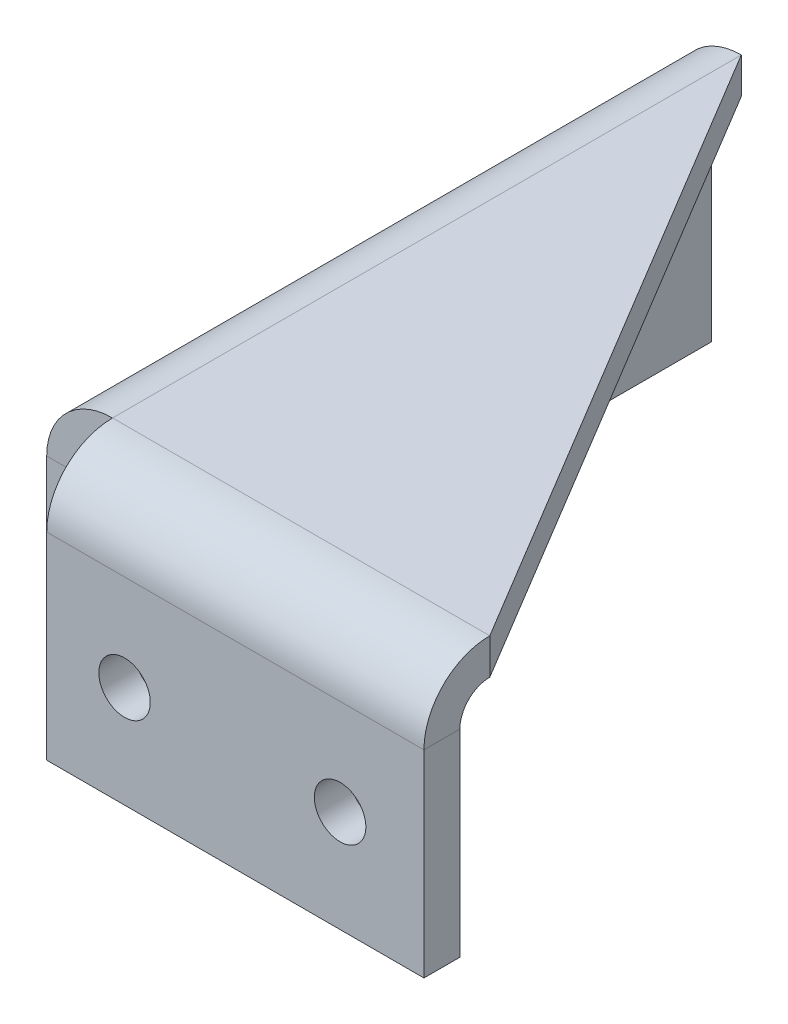
ISO-10303-21;
HEADER;
FILE_DESCRIPTION(('STEP AP214'),'2;1');
FILE_NAME('part.step','',(''),(''),'','','');
FILE_SCHEMA(('AUTOMOTIVE_DESIGN { 1 0 10303 214 1 1 1 1 }'));
ENDSEC;
DATA;
#1=APPLICATION_CONTEXT('core data for automotive mechanical design processes');
#2=APPLICATION_PROTOCOL_DEFINITION('international standard','automotive_design',2000,#1);
#3=PRODUCT_CONTEXT('',#1,'mechanical');
#4=PRODUCT('Part','Part','',(#3));
#5=PRODUCT_RELATED_PRODUCT_CATEGORY('part','',(#4));
#6=PRODUCT_DEFINITION_FORMATION('','',#4);
#7=PRODUCT_DEFINITION_CONTEXT('part definition',#1,'design');
#8=PRODUCT_DEFINITION('design','',#6,#7);
#9=PRODUCT_DEFINITION_SHAPE('','',#8);
#10=(LENGTH_UNIT() NAMED_UNIT(*) SI_UNIT(.MILLI.,.METRE.));
#11=(NAMED_UNIT(*) PLANE_ANGLE_UNIT() SI_UNIT($,.RADIAN.));
#12=(NAMED_UNIT(*) SI_UNIT($,.STERADIAN.) SOLID_ANGLE_UNIT());
#13=UNCERTAINTY_MEASURE_WITH_UNIT(LENGTH_MEASURE(1.E-05),#10,'distance_accuracy_value','');
#14=(GEOMETRIC_REPRESENTATION_CONTEXT(3) GLOBAL_UNCERTAINTY_ASSIGNED_CONTEXT((#13)) GLOBAL_UNIT_ASSIGNED_CONTEXT((#10,
#11,#12)) REPRESENTATION_CONTEXT('',''));
#15=CARTESIAN_POINT('',(0.,0.,0.));
#16=DIRECTION('',(0.,0.,1.));
#17=DIRECTION('',(1.,0.,0.));
#18=AXIS2_PLACEMENT_3D('',#15,#16,#17);
#19=CARTESIAN_POINT('',(0.,-3.,0.));
#20=DIRECTION('',(0.,1.,0.));
#21=DIRECTION('',(0.,0.,1.));
#22=AXIS2_PLACEMENT_3D('',#19,#20,#21);
#23=PLANE('',#22);
#24=DIRECTION('',(0.514495755427527,0.,0.857492925712544));
#25=VECTOR('',#24,1.);
#26=CARTESIAN_POINT('',(0.,-3.,0.));
#27=LINE('',#26,#25);
#28=CARTESIAN_POINT('',(-31.5,-3.00000000000001,-52.5));
#29=VERTEX_POINT('',#28);
#30=CARTESIAN_POINT('',(0.,-2.99999999999999,0.));
#31=VERTEX_POINT('',#30);
#32=EDGE_CURVE('E213',#29,#31,#27,.T.);
#33=ORIENTED_EDGE('',*,*,#32,.T.);
#34=DIRECTION('',(1.,0.,0.));
#35=VECTOR('',#34,1.);
#36=CARTESIAN_POINT('',(0.,-3.,0.));
#37=LINE('',#36,#35);
#38=CARTESIAN_POINT('',(-31.5,-3.,0.));
#39=VERTEX_POINT('',#38);
#40=EDGE_CURVE('E219',#39,#31,#37,.T.);
#41=ORIENTED_EDGE('',*,*,#40,.F.);
#42=DIRECTION('',(0.,0.,1.));
#43=VECTOR('',#42,1.);
#44=CARTESIAN_POINT('',(-31.5,-3.,0.));
#45=LINE('',#44,#43);
#46=EDGE_CURVE('E220',#29,#39,#45,.T.);
#47=ORIENTED_EDGE('',*,*,#46,.F.);
#48=EDGE_LOOP('',(#33,#41,#47));
#49=FACE_BOUND('',#48,.T.);
#50=ADVANCED_FACE('F90',(#49),#23,.F.);
#51=CARTESIAN_POINT('',(0.,0.,0.));
#52=DIRECTION('',(0.,1.,0.));
#53=DIRECTION('',(0.,0.,1.));
#54=AXIS2_PLACEMENT_3D('',#51,#52,#53);
#55=PLANE('',#54);
#56=DIRECTION('',(1.,0.,0.));
#57=VECTOR('',#56,1.);
#58=CARTESIAN_POINT('',(0.,0.,0.));
#59=LINE('',#58,#57);
#60=CARTESIAN_POINT('',(-31.5,0.,0.));
#61=VERTEX_POINT('',#60);
#62=CARTESIAN_POINT('',(0.,0.,0.));
#63=VERTEX_POINT('',#62);
#64=EDGE_CURVE('E238',#61,#63,#59,.T.);
#65=ORIENTED_EDGE('',*,*,#64,.T.);
#66=DIRECTION('',(0.514495755427527,0.,0.857492925712544));
#67=VECTOR('',#66,1.);
#68=CARTESIAN_POINT('',(0.,0.,0.));
#69=LINE('',#68,#67);
#70=CARTESIAN_POINT('',(-31.5,0.,-52.5));
#71=VERTEX_POINT('',#70);
#72=EDGE_CURVE('E208',#71,#63,#69,.T.);
#73=ORIENTED_EDGE('',*,*,#72,.F.);
#74=DIRECTION('',(0.,0.,1.));
#75=VECTOR('',#74,1.);
#76=CARTESIAN_POINT('',(-31.5,0.,0.));
#77=LINE('',#76,#75);
#78=EDGE_CURVE('E240',#71,#61,#77,.T.);
#79=ORIENTED_EDGE('',*,*,#78,.T.);
#80=EDGE_LOOP('',(#65,#73,#79));
#81=FACE_BOUND('',#80,.T.);
#82=ADVANCED_FACE('F92',(#81),#55,.T.);
#83=CARTESIAN_POINT('',(0.,-5.49999999999999,0.));
#84=DIRECTION('',(1.,0.,0.));
#85=DIRECTION('',(0.,0.,-1.));
#86=AXIS2_PLACEMENT_3D('',#83,#84,#85);
#87=PLANE('',#86);
#88=DIRECTION('',(0.,0.,1.));
#89=VECTOR('',#88,1.);
#90=CARTESIAN_POINT('',(0.,-5.49999999999999,5.50000000000006));
#91=LINE('',#90,#89);
#92=CARTESIAN_POINT('',(0.,-5.49999999999998,2.5));
#93=VERTEX_POINT('',#92);
#94=CARTESIAN_POINT('',(0.,-5.49999999999997,5.5));
#95=VERTEX_POINT('',#94);
#96=EDGE_CURVE('E121',#93,#95,#91,.T.);
#97=ORIENTED_EDGE('',*,*,#96,.F.);
#98=CARTESIAN_POINT('',(0.,-5.49999999999999,0.));
#99=DIRECTION('',(-1.,0.,0.));
#100=DIRECTION('',(0.,0.,1.));
#101=AXIS2_PLACEMENT_3D('',#98,#99,#100);
#102=CIRCLE('',#101,2.5);
#103=EDGE_CURVE('E226',#31,#93,#102,.F.);
#104=ORIENTED_EDGE('',*,*,#103,.F.);
#105=DIRECTION('',(0.,1.,0.));
#106=VECTOR('',#105,1.);
#107=CARTESIAN_POINT('',(0.,-3.,0.));
#108=LINE('',#107,#106);
#109=EDGE_CURVE('E15',#31,#63,#108,.T.);
#110=ORIENTED_EDGE('',*,*,#109,.T.);
#111=CARTESIAN_POINT('',(0.,-5.49999999999999,0.));
#112=DIRECTION('',(-1.,0.,0.));
#113=DIRECTION('',(0.,0.,1.));
#114=AXIS2_PLACEMENT_3D('',#111,#112,#113);
#115=CIRCLE('',#114,5.5);
#116=EDGE_CURVE('E232',#63,#95,#115,.F.);
#117=ORIENTED_EDGE('',*,*,#116,.T.);
#118=EDGE_LOOP('',(#97,#104,#110,#117));
#119=FACE_BOUND('',#118,.T.);
#120=ADVANCED_FACE('F230',(#119),#87,.T.);
#121=CARTESIAN_POINT('',(-31.5,-5.49999999999999,0.));
#122=DIRECTION('',(1.,0.,0.));
#123=DIRECTION('',(0.,0.,-1.));
#124=AXIS2_PLACEMENT_3D('',#121,#122,#123);
#125=PLANE('',#124);
#126=CARTESIAN_POINT('',(-31.5,-5.49999999999999,0.));
#127=DIRECTION('',(-1.,0.,0.));
#128=DIRECTION('',(0.,0.,1.));
#129=AXIS2_PLACEMENT_3D('',#126,#127,#128);
#130=CIRCLE('',#129,2.5);
#131=CARTESIAN_POINT('',(-31.5,-5.49999999999998,2.50000000000001));
#132=VERTEX_POINT('',#131);
#133=EDGE_CURVE('E228',#132,#39,#130,.T.);
#134=ORIENTED_EDGE('',*,*,#133,.F.);
#135=DIRECTION('',(0.,0.,1.));
#136=VECTOR('',#135,1.);
#137=CARTESIAN_POINT('',(-31.5,-5.49999999999999,2.5));
#138=LINE('',#137,#136);
#139=CARTESIAN_POINT('',(-31.5,-5.49999999999999,5.5));
#140=VERTEX_POINT('',#139);
#141=EDGE_CURVE('E251',#132,#140,#138,.T.);
#142=ORIENTED_EDGE('',*,*,#141,.T.);
#143=CARTESIAN_POINT('',(-31.5,-5.49999999999999,0.));
#144=DIRECTION('',(-1.,0.,0.));
#145=DIRECTION('',(0.,0.,1.));
#146=AXIS2_PLACEMENT_3D('',#143,#144,#145);
#147=CIRCLE('',#146,5.5);
#148=EDGE_CURVE('E130',#140,#61,#147,.T.);
#149=ORIENTED_EDGE('',*,*,#148,.T.);
#150=DIRECTION('',(0.,1.,0.));
#151=VECTOR('',#150,1.);
#152=CARTESIAN_POINT('',(-31.5,-3.,0.));
#153=LINE('',#152,#151);
#154=EDGE_CURVE('E100',#39,#61,#153,.T.);
#155=ORIENTED_EDGE('',*,*,#154,.F.);
#156=EDGE_LOOP('',(#134,#142,#149,#155));
#157=FACE_BOUND('',#156,.T.);
#158=ADVANCED_FACE('F249',(#157),#125,.F.);
#159=CARTESIAN_POINT('',(-31.5,-5.49999999999999,0.));
#160=DIRECTION('',(-1.,0.,0.));
#161=DIRECTION('',(0.,0.,1.));
#162=AXIS2_PLACEMENT_3D('',#159,#160,#161);
#163=CYLINDRICAL_SURFACE('',#162,5.5);
#164=ORIENTED_EDGE('',*,*,#64,.F.);
#165=ORIENTED_EDGE('',*,*,#148,.F.);
#166=DIRECTION('',(-1.,0.,0.));
#167=VECTOR('',#166,1.);
#168=CARTESIAN_POINT('',(0.,-5.49999999999999,5.5));
#169=LINE('',#168,#167);
#170=EDGE_CURVE('E284',#95,#140,#169,.T.);
#171=ORIENTED_EDGE('',*,*,#170,.F.);
#172=ORIENTED_EDGE('',*,*,#116,.F.);
#173=EDGE_LOOP('',(#164,#165,#171,#172));
#174=FACE_BOUND('',#173,.T.);
#175=ADVANCED_FACE('F247',(#174),#163,.T.);
#176=CARTESIAN_POINT('',(-31.5,-5.49999999999999,0.));
#177=DIRECTION('',(-1.,0.,0.));
#178=DIRECTION('',(0.,0.,1.));
#179=AXIS2_PLACEMENT_3D('',#176,#177,#178);
#180=CYLINDRICAL_SURFACE('',#179,2.5);
#181=ORIENTED_EDGE('',*,*,#40,.T.);
#182=ORIENTED_EDGE('',*,*,#103,.T.);
#183=DIRECTION('',(1.,0.,0.));
#184=VECTOR('',#183,1.);
#185=CARTESIAN_POINT('',(0.,-5.49999999999999,2.5));
#186=LINE('',#185,#184);
#187=EDGE_CURVE('E287',#93,#132,#186,.F.);
#188=ORIENTED_EDGE('',*,*,#187,.T.);
#189=ORIENTED_EDGE('',*,*,#133,.T.);
#190=EDGE_LOOP('',(#181,#182,#188,#189));
#191=FACE_BOUND('',#190,.T.);
#192=ADVANCED_FACE('F225',(#191),#180,.F.);
#193=CARTESIAN_POINT('',(-31.5,-2.99999999999999,5.5));
#194=DIRECTION('',(-1.,0.,0.));
#195=DIRECTION('',(0.,0.,1.));
#196=AXIS2_PLACEMENT_3D('',#193,#194,#195);
#197=PLANE('',#196);
#198=DIRECTION('',(0.,1.,0.));
#199=VECTOR('',#198,1.);
#200=CARTESIAN_POINT('',(-31.5,-2.99999999999999,5.5));
#201=LINE('',#200,#199);
#202=CARTESIAN_POINT('',(-31.5,-22.,5.50000000000006));
#203=VERTEX_POINT('',#202);
#204=EDGE_CURVE('E275',#203,#140,#201,.T.);
#205=ORIENTED_EDGE('',*,*,#204,.T.);
#206=ORIENTED_EDGE('',*,*,#141,.F.);
#207=DIRECTION('',(0.,-1.,0.));
#208=VECTOR('',#207,1.);
#209=CARTESIAN_POINT('',(-31.5,0.,2.49999999999998));
#210=LINE('',#209,#208);
#211=CARTESIAN_POINT('',(-31.5,-22.,2.50000000000006));
#212=VERTEX_POINT('',#211);
#213=EDGE_CURVE('E281',#212,#132,#210,.F.);
#214=ORIENTED_EDGE('',*,*,#213,.F.);
#215=DIRECTION('',(0.,0.,-1.));
#216=VECTOR('',#215,1.);
#217=CARTESIAN_POINT('',(-31.5,-22.,5.50000000000006));
#218=LINE('',#217,#216);
#219=EDGE_CURVE('E234',#203,#212,#218,.T.);
#220=ORIENTED_EDGE('',*,*,#219,.F.);
#221=EDGE_LOOP('',(#205,#206,#214,#220));
#222=FACE_BOUND('',#221,.T.);
#223=ADVANCED_FACE('F303',(#222),#197,.T.);
#224=CARTESIAN_POINT('',(0.,-22.,5.50000000000006));
#225=DIRECTION('',(1.,0.,0.));
#226=DIRECTION('',(0.,0.,-1.));
#227=AXIS2_PLACEMENT_3D('',#224,#225,#226);
#228=PLANE('',#227);
#229=DIRECTION('',(0.,1.,0.));
#230=VECTOR('',#229,1.);
#231=CARTESIAN_POINT('',(0.,0.,2.49999999999998));
#232=LINE('',#231,#230);
#233=CARTESIAN_POINT('',(0.,-22.,2.50000000000006));
#234=VERTEX_POINT('',#233);
#235=EDGE_CURVE('E150',#93,#234,#232,.F.);
#236=ORIENTED_EDGE('',*,*,#235,.F.);
#237=ORIENTED_EDGE('',*,*,#96,.T.);
#238=DIRECTION('',(0.,-1.,0.));
#239=VECTOR('',#238,1.);
#240=CARTESIAN_POINT('',(0.,-22.,5.50000000000006));
#241=LINE('',#240,#239);
#242=CARTESIAN_POINT('',(0.,-22.,5.50000000000006));
#243=VERTEX_POINT('',#242);
#244=EDGE_CURVE('E273',#95,#243,#241,.T.);
#245=ORIENTED_EDGE('',*,*,#244,.T.);
#246=DIRECTION('',(0.,0.,-1.));
#247=VECTOR('',#246,1.);
#248=CARTESIAN_POINT('',(0.,-22.,5.50000000000006));
#249=LINE('',#248,#247);
#250=EDGE_CURVE('E268',#243,#234,#249,.T.);
#251=ORIENTED_EDGE('',*,*,#250,.T.);
#252=EDGE_LOOP('',(#236,#237,#245,#251));
#253=FACE_BOUND('',#252,.T.);
#254=ADVANCED_FACE('F291',(#253),#228,.T.);
#255=CARTESIAN_POINT('',(0.,0.,5.49999999999998));
#256=DIRECTION('',(0.,0.,1.));
#257=DIRECTION('',(0.,-1.,0.));
#258=AXIS2_PLACEMENT_3D('',#255,#256,#257);
#259=PLANE('',#258);
#260=CARTESIAN_POINT('',(-7.,-13.5,5.49999999999998));
#261=DIRECTION('',(0.,0.,-1.));
#262=DIRECTION('',(-1.,0.,0.));
#263=AXIS2_PLACEMENT_3D('',#260,#261,#262);
#264=CIRCLE('',#263,2.15);
#265=CARTESIAN_POINT('',(-9.15,-13.5,5.49999999999998));
#266=VERTEX_POINT('',#265);
#267=EDGE_CURVE('E600',#266,#266,#264,.T.);
#268=ORIENTED_EDGE('',*,*,#267,.T.);
#269=EDGE_LOOP('',(#268));
#270=FACE_BOUND('',#269,.T.);
#271=CARTESIAN_POINT('',(-25.,-13.5,5.49999999999998));
#272=DIRECTION('',(0.,0.,-1.));
#273=DIRECTION('',(-1.,0.,0.));
#274=AXIS2_PLACEMENT_3D('',#271,#272,#273);
#275=CIRCLE('',#274,2.15);
#276=CARTESIAN_POINT('',(-27.15,-13.5,5.49999999999998));
#277=VERTEX_POINT('',#276);
#278=EDGE_CURVE('E221',#277,#277,#275,.T.);
#279=ORIENTED_EDGE('',*,*,#278,.T.);
#280=EDGE_LOOP('',(#279));
#281=FACE_BOUND('',#280,.T.);
#282=ORIENTED_EDGE('',*,*,#244,.F.);
#283=ORIENTED_EDGE('',*,*,#170,.T.);
#284=ORIENTED_EDGE('',*,*,#204,.F.);
#285=DIRECTION('',(-1.,0.,0.));
#286=VECTOR('',#285,1.);
#287=CARTESIAN_POINT('',(-31.5,-22.,5.50000000000006));
#288=LINE('',#287,#286);
#289=EDGE_CURVE('E270',#243,#203,#288,.T.);
#290=ORIENTED_EDGE('',*,*,#289,.F.);
#291=EDGE_LOOP('',(#282,#283,#284,#290));
#292=FACE_BOUND('',#291,.T.);
#293=ADVANCED_FACE('F295',(#270,#281,#292),#259,.T.);
#294=CARTESIAN_POINT('',(0.,0.,2.49999999999998));
#295=DIRECTION('',(0.,0.,1.));
#296=DIRECTION('',(0.,-1.,0.));
#297=AXIS2_PLACEMENT_3D('',#294,#295,#296);
#298=PLANE('',#297);
#299=CARTESIAN_POINT('',(-7.,-13.5,2.49999999999998));
#300=DIRECTION('',(0.,0.,-1.));
#301=DIRECTION('',(-1.,0.,0.));
#302=AXIS2_PLACEMENT_3D('',#299,#300,#301);
#303=CIRCLE('',#302,2.14999999999999);
#304=CARTESIAN_POINT('',(-9.14999999999999,-13.5,2.49999999999998));
#305=VERTEX_POINT('',#304);
#306=EDGE_CURVE('E603',#305,#305,#303,.T.);
#307=ORIENTED_EDGE('',*,*,#306,.F.);
#308=EDGE_LOOP('',(#307));
#309=FACE_BOUND('',#308,.T.);
#310=CARTESIAN_POINT('',(-25.,-13.5,2.49999999999998));
#311=DIRECTION('',(0.,0.,-1.));
#312=DIRECTION('',(-1.,0.,0.));
#313=AXIS2_PLACEMENT_3D('',#310,#311,#312);
#314=CIRCLE('',#313,2.14999999999999);
#315=CARTESIAN_POINT('',(-27.15,-13.5,2.49999999999998));
#316=VERTEX_POINT('',#315);
#317=EDGE_CURVE('E597',#316,#316,#314,.T.);
#318=ORIENTED_EDGE('',*,*,#317,.F.);
#319=EDGE_LOOP('',(#318));
#320=FACE_BOUND('',#319,.T.);
#321=ORIENTED_EDGE('',*,*,#187,.F.);
#322=ORIENTED_EDGE('',*,*,#235,.T.);
#323=DIRECTION('',(1.,0.,0.));
#324=VECTOR('',#323,1.);
#325=CARTESIAN_POINT('',(0.,-22.,2.50000000000006));
#326=LINE('',#325,#324);
#327=EDGE_CURVE('E278',#234,#212,#326,.F.);
#328=ORIENTED_EDGE('',*,*,#327,.T.);
#329=ORIENTED_EDGE('',*,*,#213,.T.);
#330=EDGE_LOOP('',(#321,#322,#328,#329));
#331=FACE_BOUND('',#330,.T.);
#332=ADVANCED_FACE('F301',(#309,#320,#331),#298,.F.);
#333=CARTESIAN_POINT('',(-31.5,-22.,5.50000000000006));
#334=DIRECTION('',(0.,-1.,0.));
#335=DIRECTION('',(0.,0.,-1.));
#336=AXIS2_PLACEMENT_3D('',#333,#334,#335);
#337=PLANE('',#336);
#338=ORIENTED_EDGE('',*,*,#327,.F.);
#339=ORIENTED_EDGE('',*,*,#250,.F.);
#340=ORIENTED_EDGE('',*,*,#289,.T.);
#341=ORIENTED_EDGE('',*,*,#219,.T.);
#342=EDGE_LOOP('',(#338,#339,#340,#341));
#343=FACE_BOUND('',#342,.T.);
#344=ADVANCED_FACE('F299',(#343),#337,.T.);
#345=CARTESIAN_POINT('',(-31.5,-5.49999999999999,0.));
#346=DIRECTION('',(0.,0.,1.));
#347=DIRECTION('',(0.,-1.,0.));
#348=AXIS2_PLACEMENT_3D('',#345,#346,#347);
#349=PLANE('',#348);
#350=DIRECTION('',(-1.,0.,0.));
#351=VECTOR('',#350,1.);
#352=CARTESIAN_POINT('',(-37.,-5.49999999999997,0.));
#353=LINE('',#352,#351);
#354=CARTESIAN_POINT('',(-34.,-5.49999999999998,0.));
#355=VERTEX_POINT('',#354);
#356=CARTESIAN_POINT('',(-37.,-5.49999999999997,0.));
#357=VERTEX_POINT('',#356);
#358=EDGE_CURVE('E171',#355,#357,#353,.T.);
#359=ORIENTED_EDGE('',*,*,#358,.F.);
#360=CARTESIAN_POINT('',(-31.5,-5.49999999999999,0.));
#361=DIRECTION('',(0.,0.,-1.));
#362=DIRECTION('',(0.,1.,0.));
#363=AXIS2_PLACEMENT_3D('',#360,#361,#362);
#364=CIRCLE('',#363,2.5);
#365=EDGE_CURVE('E245',#39,#355,#364,.F.);
#366=ORIENTED_EDGE('',*,*,#365,.F.);
#367=ORIENTED_EDGE('',*,*,#154,.T.);
#368=CARTESIAN_POINT('',(-31.5,-5.49999999999999,0.));
#369=DIRECTION('',(0.,0.,-1.));
#370=DIRECTION('',(0.,1.,0.));
#371=AXIS2_PLACEMENT_3D('',#368,#369,#370);
#372=CIRCLE('',#371,5.5);
#373=EDGE_CURVE('E109',#61,#357,#372,.F.);
#374=ORIENTED_EDGE('',*,*,#373,.T.);
#375=EDGE_LOOP('',(#359,#366,#367,#374));
#376=FACE_BOUND('',#375,.T.);
#377=ADVANCED_FACE('F244',(#376),#349,.T.);
#378=CARTESIAN_POINT('',(-31.5,-5.5,-52.5));
#379=DIRECTION('',(0.,0.,1.));
#380=DIRECTION('',(0.,-1.,0.));
#381=AXIS2_PLACEMENT_3D('',#378,#379,#380);
#382=PLANE('',#381);
#383=CARTESIAN_POINT('',(-31.5,-5.5,-52.5));
#384=DIRECTION('',(0.,0.,-1.));
#385=DIRECTION('',(0.,1.,0.));
#386=AXIS2_PLACEMENT_3D('',#383,#384,#385);
#387=CIRCLE('',#386,2.5);
#388=CARTESIAN_POINT('',(-34.,-5.49999999999999,-52.5));
#389=VERTEX_POINT('',#388);
#390=EDGE_CURVE('E262',#389,#29,#387,.T.);
#391=ORIENTED_EDGE('',*,*,#390,.F.);
#392=DIRECTION('',(-1.,0.,0.));
#393=VECTOR('',#392,1.);
#394=CARTESIAN_POINT('',(-34.,-5.49999999999999,-52.5));
#395=LINE('',#394,#393);
#396=CARTESIAN_POINT('',(-37.,-5.49999999999998,-52.5));
#397=VERTEX_POINT('',#396);
#398=EDGE_CURVE('E259',#389,#397,#395,.T.);
#399=ORIENTED_EDGE('',*,*,#398,.T.);
#400=CARTESIAN_POINT('',(-31.5,-5.5,-52.5));
#401=DIRECTION('',(0.,0.,-1.));
#402=DIRECTION('',(0.,1.,0.));
#403=AXIS2_PLACEMENT_3D('',#400,#401,#402);
#404=CIRCLE('',#403,5.5);
#405=EDGE_CURVE('E177',#397,#71,#404,.T.);
#406=ORIENTED_EDGE('',*,*,#405,.T.);
#407=DIRECTION('',(0.,1.,0.));
#408=VECTOR('',#407,1.);
#409=CARTESIAN_POINT('',(-31.5,-3.,-52.5));
#410=LINE('',#409,#408);
#411=EDGE_CURVE('E94',#29,#71,#410,.T.);
#412=ORIENTED_EDGE('',*,*,#411,.F.);
#413=EDGE_LOOP('',(#391,#399,#406,#412));
#414=FACE_BOUND('',#413,.T.);
#415=ADVANCED_FACE('F256',(#414),#382,.F.);
#416=CARTESIAN_POINT('',(-31.5,-5.5,-52.5));
#417=DIRECTION('',(0.,0.,-1.));
#418=DIRECTION('',(-1.,0.,0.));
#419=AXIS2_PLACEMENT_3D('',#416,#417,#418);
#420=CYLINDRICAL_SURFACE('',#419,5.5);
#421=ORIENTED_EDGE('',*,*,#78,.F.);
#422=ORIENTED_EDGE('',*,*,#405,.F.);
#423=DIRECTION('',(0.,0.,-1.));
#424=VECTOR('',#423,1.);
#425=CARTESIAN_POINT('',(-37.,-5.49999999999997,0.));
#426=LINE('',#425,#424);
#427=EDGE_CURVE('E156',#357,#397,#426,.T.);
#428=ORIENTED_EDGE('',*,*,#427,.F.);
#429=ORIENTED_EDGE('',*,*,#373,.F.);
#430=EDGE_LOOP('',(#421,#422,#428,#429));
#431=FACE_BOUND('',#430,.T.);
#432=ADVANCED_FACE('F253',(#431),#420,.T.);
#433=CARTESIAN_POINT('',(-31.5,-5.5,-52.5));
#434=DIRECTION('',(0.,0.,-1.));
#435=DIRECTION('',(-1.,0.,0.));
#436=AXIS2_PLACEMENT_3D('',#433,#434,#435);
#437=CYLINDRICAL_SURFACE('',#436,2.5);
#438=ORIENTED_EDGE('',*,*,#46,.T.);
#439=ORIENTED_EDGE('',*,*,#365,.T.);
#440=DIRECTION('',(0.,0.,1.));
#441=VECTOR('',#440,1.);
#442=CARTESIAN_POINT('',(-34.,-5.49999999999998,0.));
#443=LINE('',#442,#441);
#444=EDGE_CURVE('E578',#355,#389,#443,.F.);
#445=ORIENTED_EDGE('',*,*,#444,.T.);
#446=ORIENTED_EDGE('',*,*,#390,.T.);
#447=EDGE_LOOP('',(#438,#439,#445,#446));
#448=FACE_BOUND('',#447,.T.);
#449=ADVANCED_FACE('F353',(#448),#437,.F.);
#450=CARTESIAN_POINT('',(-37.,-2.99999999999999,-52.5));
#451=DIRECTION('',(0.,0.,-1.));
#452=DIRECTION('',(0.,1.,0.));
#453=AXIS2_PLACEMENT_3D('',#450,#451,#452);
#454=PLANE('',#453);
#455=DIRECTION('',(0.,1.,0.));
#456=VECTOR('',#455,1.);
#457=CARTESIAN_POINT('',(-37.,-2.99999999999999,-52.5));
#458=LINE('',#457,#456);
#459=CARTESIAN_POINT('',(-37.0000000000001,-22.,-52.5));
#460=VERTEX_POINT('',#459);
#461=EDGE_CURVE('E585',#460,#397,#458,.T.);
#462=ORIENTED_EDGE('',*,*,#461,.T.);
#463=ORIENTED_EDGE('',*,*,#398,.F.);
#464=DIRECTION('',(0.,-1.,0.));
#465=VECTOR('',#464,1.);
#466=CARTESIAN_POINT('',(-34.,0.,-52.5));
#467=LINE('',#466,#465);
#468=CARTESIAN_POINT('',(-34.0000000000001,-22.,-52.5));
#469=VERTEX_POINT('',#468);
#470=EDGE_CURVE('E572',#469,#389,#467,.F.);
#471=ORIENTED_EDGE('',*,*,#470,.F.);
#472=DIRECTION('',(1.,0.,0.));
#473=VECTOR('',#472,1.);
#474=CARTESIAN_POINT('',(-37.0000000000001,-22.,-52.5));
#475=LINE('',#474,#473);
#476=EDGE_CURVE('E192',#460,#469,#475,.T.);
#477=ORIENTED_EDGE('',*,*,#476,.F.);
#478=EDGE_LOOP('',(#462,#463,#471,#477));
#479=FACE_BOUND('',#478,.T.);
#480=ADVANCED_FACE('F363',(#479),#454,.T.);
#481=CARTESIAN_POINT('',(-37.0000000000001,-22.,0.));
#482=DIRECTION('',(0.,0.,1.));
#483=DIRECTION('',(0.,-1.,0.));
#484=AXIS2_PLACEMENT_3D('',#481,#482,#483);
#485=PLANE('',#484);
#486=DIRECTION('',(0.,1.,0.));
#487=VECTOR('',#486,1.);
#488=CARTESIAN_POINT('',(-34.,1.15039556827936E-13,0.));
#489=LINE('',#488,#487);
#490=CARTESIAN_POINT('',(-34.0000000000001,-22.,0.));
#491=VERTEX_POINT('',#490);
#492=EDGE_CURVE('E199',#355,#491,#489,.F.);
#493=ORIENTED_EDGE('',*,*,#492,.F.);
#494=ORIENTED_EDGE('',*,*,#358,.T.);
#495=DIRECTION('',(0.,-1.,0.));
#496=VECTOR('',#495,1.);
#497=CARTESIAN_POINT('',(-37.0000000000001,-22.,0.));
#498=LINE('',#497,#496);
#499=CARTESIAN_POINT('',(-37.0000000000001,-22.,0.));
#500=VERTEX_POINT('',#499);
#501=EDGE_CURVE('E590',#357,#500,#498,.T.);
#502=ORIENTED_EDGE('',*,*,#501,.T.);
#503=DIRECTION('',(1.,0.,0.));
#504=VECTOR('',#503,1.);
#505=CARTESIAN_POINT('',(-37.0000000000001,-22.,0.));
#506=LINE('',#505,#504);
#507=EDGE_CURVE('E569',#500,#491,#506,.T.);
#508=ORIENTED_EDGE('',*,*,#507,.T.);
#509=EDGE_LOOP('',(#493,#494,#502,#508));
#510=FACE_BOUND('',#509,.T.);
#511=ADVANCED_FACE('F436',(#510),#485,.T.);
#512=CARTESIAN_POINT('',(-37.,1.25514000844465E-13,0.));
#513=DIRECTION('',(-1.,0.,0.));
#514=DIRECTION('',(0.,-1.,0.));
#515=AXIS2_PLACEMENT_3D('',#512,#513,#514);
#516=PLANE('',#515);
#517=CARTESIAN_POINT('',(-37.,-13.5,-44.5));
#518=DIRECTION('',(1.,0.,0.));
#519=DIRECTION('',(0.,0.,-1.));
#520=AXIS2_PLACEMENT_3D('',#517,#518,#519);
#521=CIRCLE('',#520,2.15);
#522=CARTESIAN_POINT('',(-37.,-13.5,-46.65));
#523=VERTEX_POINT('',#522);
#524=EDGE_CURVE('E612',#523,#523,#521,.T.);
#525=ORIENTED_EDGE('',*,*,#524,.T.);
#526=EDGE_LOOP('',(#525));
#527=FACE_BOUND('',#526,.T.);
#528=CARTESIAN_POINT('',(-37.,-13.5,-8.49999999999998));
#529=DIRECTION('',(1.,0.,0.));
#530=DIRECTION('',(0.,0.,-1.));
#531=AXIS2_PLACEMENT_3D('',#528,#529,#530);
#532=CIRCLE('',#531,2.15);
#533=CARTESIAN_POINT('',(-37.,-13.5,-10.65));
#534=VERTEX_POINT('',#533);
#535=EDGE_CURVE('E606',#534,#534,#532,.T.);
#536=ORIENTED_EDGE('',*,*,#535,.T.);
#537=EDGE_LOOP('',(#536));
#538=FACE_BOUND('',#537,.T.);
#539=ORIENTED_EDGE('',*,*,#501,.F.);
#540=ORIENTED_EDGE('',*,*,#427,.T.);
#541=ORIENTED_EDGE('',*,*,#461,.F.);
#542=DIRECTION('',(0.,0.,-1.));
#543=VECTOR('',#542,1.);
#544=CARTESIAN_POINT('',(-37.0000000000001,-22.,-52.5));
#545=LINE('',#544,#543);
#546=EDGE_CURVE('E588',#500,#460,#545,.T.);
#547=ORIENTED_EDGE('',*,*,#546,.F.);
#548=EDGE_LOOP('',(#539,#540,#541,#547));
#549=FACE_BOUND('',#548,.T.);
#550=ADVANCED_FACE('F430',(#527,#538,#549),#516,.T.);
#551=CARTESIAN_POINT('',(-34.,1.15039556827936E-13,0.));
#552=DIRECTION('',(-1.,0.,0.));
#553=DIRECTION('',(0.,-1.,0.));
#554=AXIS2_PLACEMENT_3D('',#551,#552,#553);
#555=PLANE('',#554);
#556=CARTESIAN_POINT('',(-33.9999999999999,-13.5,-44.5));
#557=DIRECTION('',(1.,0.,0.));
#558=DIRECTION('',(0.,0.,-1.));
#559=AXIS2_PLACEMENT_3D('',#556,#557,#558);
#560=CIRCLE('',#559,2.14999999999999);
#561=CARTESIAN_POINT('',(-33.9999999999999,-13.5,-46.65));
#562=VERTEX_POINT('',#561);
#563=EDGE_CURVE('E615',#562,#562,#560,.T.);
#564=ORIENTED_EDGE('',*,*,#563,.F.);
#565=EDGE_LOOP('',(#564));
#566=FACE_BOUND('',#565,.T.);
#567=CARTESIAN_POINT('',(-33.9999999999999,-13.5,-8.49999999999998));
#568=DIRECTION('',(1.,0.,0.));
#569=DIRECTION('',(0.,0.,-1.));
#570=AXIS2_PLACEMENT_3D('',#567,#568,#569);
#571=CIRCLE('',#570,2.14999999999999);
#572=CARTESIAN_POINT('',(-33.9999999999999,-13.5,-10.65));
#573=VERTEX_POINT('',#572);
#574=EDGE_CURVE('E609',#573,#573,#571,.T.);
#575=ORIENTED_EDGE('',*,*,#574,.F.);
#576=EDGE_LOOP('',(#575));
#577=FACE_BOUND('',#576,.T.);
#578=ORIENTED_EDGE('',*,*,#444,.F.);
#579=ORIENTED_EDGE('',*,*,#492,.T.);
#580=DIRECTION('',(0.,0.,1.));
#581=VECTOR('',#580,1.);
#582=CARTESIAN_POINT('',(-34.0000000000001,-22.,0.));
#583=LINE('',#582,#581);
#584=EDGE_CURVE('E570',#491,#469,#583,.F.);
#585=ORIENTED_EDGE('',*,*,#584,.T.);
#586=ORIENTED_EDGE('',*,*,#470,.T.);
#587=EDGE_LOOP('',(#578,#579,#585,#586));
#588=FACE_BOUND('',#587,.T.);
#589=ADVANCED_FACE('F435',(#566,#577,#588),#555,.F.);
#590=CARTESIAN_POINT('',(-37.0000000000001,-22.,-52.5));
#591=DIRECTION('',(0.,-1.,0.));
#592=DIRECTION('',(1.,0.,0.));
#593=AXIS2_PLACEMENT_3D('',#590,#591,#592);
#594=PLANE('',#593);
#595=ORIENTED_EDGE('',*,*,#584,.F.);
#596=ORIENTED_EDGE('',*,*,#507,.F.);
#597=ORIENTED_EDGE('',*,*,#546,.T.);
#598=ORIENTED_EDGE('',*,*,#476,.T.);
#599=EDGE_LOOP('',(#595,#596,#597,#598));
#600=FACE_BOUND('',#599,.T.);
#601=ADVANCED_FACE('F377',(#600),#594,.T.);
#602=CARTESIAN_POINT('',(0.,-3.,0.));
#603=DIRECTION('',(-0.857492925712544,0.,0.514495755427527));
#604=DIRECTION('',(0.514495755427527,0.,0.857492925712544));
#605=AXIS2_PLACEMENT_3D('',#602,#603,#604);
#606=PLANE('',#605);
#607=ORIENTED_EDGE('',*,*,#109,.F.);
#608=ORIENTED_EDGE('',*,*,#32,.F.);
#609=ORIENTED_EDGE('',*,*,#411,.T.);
#610=ORIENTED_EDGE('',*,*,#72,.T.);
#611=EDGE_LOOP('',(#607,#608,#609,#610));
#612=FACE_BOUND('',#611,.T.);
#613=ADVANCED_FACE('F212',(#612),#606,.F.);
#614=CARTESIAN_POINT('',(-25.,-13.5,2.49999999999998));
#615=DIRECTION('',(0.,0.,-1.));
#616=DIRECTION('',(-1.,0.,0.));
#617=AXIS2_PLACEMENT_3D('',#614,#615,#616);
#618=CYLINDRICAL_SURFACE('',#617,2.14999999999999);
#619=ORIENTED_EDGE('',*,*,#278,.F.);
#620=EDGE_LOOP('',(#619));
#621=FACE_BOUND('',#620,.T.);
#622=ORIENTED_EDGE('',*,*,#317,.T.);
#623=EDGE_LOOP('',(#622));
#624=FACE_BOUND('',#623,.T.);
#625=ADVANCED_FACE('F376',(#621,#624),#618,.F.);
#626=CARTESIAN_POINT('',(-7.,-13.5,2.49999999999998));
#627=DIRECTION('',(0.,0.,-1.));
#628=DIRECTION('',(-1.,0.,0.));
#629=AXIS2_PLACEMENT_3D('',#626,#627,#628);
#630=CYLINDRICAL_SURFACE('',#629,2.14999999999999);
#631=ORIENTED_EDGE('',*,*,#267,.F.);
#632=EDGE_LOOP('',(#631));
#633=FACE_BOUND('',#632,.T.);
#634=ORIENTED_EDGE('',*,*,#306,.T.);
#635=EDGE_LOOP('',(#634));
#636=FACE_BOUND('',#635,.T.);
#637=ADVANCED_FACE('F412',(#633,#636),#630,.F.);
#638=CARTESIAN_POINT('',(-33.9999999999999,-13.5,-8.49999999999998));
#639=DIRECTION('',(1.,0.,0.));
#640=DIRECTION('',(0.,0.,-1.));
#641=AXIS2_PLACEMENT_3D('',#638,#639,#640);
#642=CYLINDRICAL_SURFACE('',#641,2.14999999999999);
#643=ORIENTED_EDGE('',*,*,#535,.F.);
#644=EDGE_LOOP('',(#643));
#645=FACE_BOUND('',#644,.T.);
#646=ORIENTED_EDGE('',*,*,#574,.T.);
#647=EDGE_LOOP('',(#646));
#648=FACE_BOUND('',#647,.T.);
#649=ADVANCED_FACE('F422',(#645,#648),#642,.F.);
#650=CARTESIAN_POINT('',(-33.9999999999999,-13.5,-44.5));
#651=DIRECTION('',(1.,0.,0.));
#652=DIRECTION('',(0.,0.,-1.));
#653=AXIS2_PLACEMENT_3D('',#650,#651,#652);
#654=CYLINDRICAL_SURFACE('',#653,2.14999999999999);
#655=ORIENTED_EDGE('',*,*,#524,.F.);
#656=EDGE_LOOP('',(#655));
#657=FACE_BOUND('',#656,.T.);
#658=ORIENTED_EDGE('',*,*,#563,.T.);
#659=EDGE_LOOP('',(#658));
#660=FACE_BOUND('',#659,.T.);
#661=ADVANCED_FACE('F458',(#657,#660),#654,.F.);
#662=CLOSED_SHELL('',(#50,#82,#120,#158,#175,#192,#223,#254,#293,#332,#344,#377,#415,#432,#449,
#480,#511,#550,#589,#601,#613,#625,#637,#649,#661));
#663=MANIFOLD_SOLID_BREP('B2',#662);
#664=ADVANCED_BREP_SHAPE_REPRESENTATION('',(#18,#663),#14);
#665=SHAPE_DEFINITION_REPRESENTATION(#9,#664);
ENDSEC;
END-ISO-10303-21;
